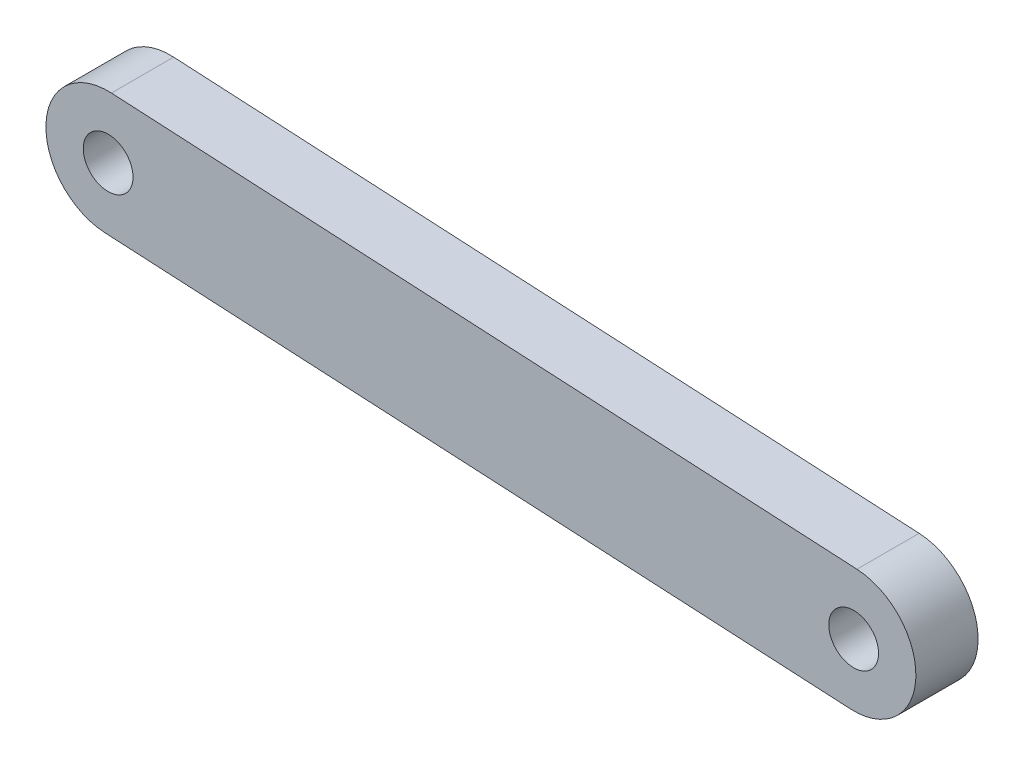
ISO-10303-21;
HEADER;
FILE_DESCRIPTION(('STEP AP214'),'2;1');
FILE_NAME('part.step','',(''),(''),'','','');
FILE_SCHEMA(('AUTOMOTIVE_DESIGN { 1 0 10303 214 1 1 1 1 }'));
ENDSEC;
DATA;
#1=APPLICATION_CONTEXT('core data for automotive mechanical design processes');
#2=APPLICATION_PROTOCOL_DEFINITION('international standard','automotive_design',2000,#1);
#3=PRODUCT_CONTEXT('',#1,'mechanical');
#4=PRODUCT('Part','Part','',(#3));
#5=PRODUCT_RELATED_PRODUCT_CATEGORY('part','',(#4));
#6=PRODUCT_DEFINITION_FORMATION('','',#4);
#7=PRODUCT_DEFINITION_CONTEXT('part definition',#1,'design');
#8=PRODUCT_DEFINITION('design','',#6,#7);
#9=PRODUCT_DEFINITION_SHAPE('','',#8);
#10=(LENGTH_UNIT() NAMED_UNIT(*) SI_UNIT(.MILLI.,.METRE.));
#11=(NAMED_UNIT(*) PLANE_ANGLE_UNIT() SI_UNIT($,.RADIAN.));
#12=(NAMED_UNIT(*) SI_UNIT($,.STERADIAN.) SOLID_ANGLE_UNIT());
#13=UNCERTAINTY_MEASURE_WITH_UNIT(LENGTH_MEASURE(1.E-05),#10,'distance_accuracy_value','');
#14=(GEOMETRIC_REPRESENTATION_CONTEXT(3) GLOBAL_UNCERTAINTY_ASSIGNED_CONTEXT((#13)) GLOBAL_UNIT_ASSIGNED_CONTEXT((#10,
#11,#12)) REPRESENTATION_CONTEXT('',''));
#15=CARTESIAN_POINT('',(0.,0.,0.));
#16=DIRECTION('',(0.,0.,1.));
#17=DIRECTION('',(1.,0.,0.));
#18=AXIS2_PLACEMENT_3D('',#15,#16,#17);
#19=CARTESIAN_POINT('',(-35.5373266073171,-8.81247047670461,5.));
#20=DIRECTION('',(0.,0.,1.));
#21=DIRECTION('',(0.,-1.,0.));
#22=AXIS2_PLACEMENT_3D('',#19,#20,#21);
#23=PLANE('',#22);
#24=CARTESIAN_POINT('',(-35.5373266073171,-8.81247047670461,5.));
#25=DIRECTION('',(0.,0.,1.));
#26=DIRECTION('',(0.,-1.,0.));
#27=AXIS2_PLACEMENT_3D('',#24,#25,#26);
#28=CIRCLE('',#27,2.);
#29=CARTESIAN_POINT('',(-35.5373266073171,-10.8124704767046,5.));
#30=VERTEX_POINT('',#29);
#31=EDGE_CURVE('E102',#30,#30,#28,.T.);
#32=ORIENTED_EDGE('',*,*,#31,.F.);
#33=EDGE_LOOP('',(#32));
#34=FACE_BOUND('',#33,.T.);
#35=CARTESIAN_POINT('',(-35.5373266073171,-8.81247047670461,5.));
#36=DIRECTION('',(0.,0.,1.));
#37=DIRECTION('',(0.,-1.,0.));
#38=AXIS2_PLACEMENT_3D('',#35,#36,#37);
#39=CIRCLE('',#38,5.);
#40=CARTESIAN_POINT('',(-35.802717202182,-13.8054222922299,5.));
#41=VERTEX_POINT('',#40);
#42=CARTESIAN_POINT('',(-35.2719360124522,-3.81951866117932,5.));
#43=VERTEX_POINT('',#42);
#44=EDGE_CURVE('E87',#41,#43,#39,.T.);
#45=ORIENTED_EDGE('',*,*,#44,.T.);
#46=DIRECTION('',(-0.998590363105057,0.0530781189729777,0.));
#47=VECTOR('',#46,1.);
#48=CARTESIAN_POINT('',(-35.2719360124522,-3.81951866117932,5.));
#49=LINE('',#48,#47);
#50=CARTESIAN_POINT('',(-95.1873577987556,-0.634831522800653,5.));
#51=VERTEX_POINT('',#50);
#52=EDGE_CURVE('E82',#43,#51,#49,.T.);
#53=ORIENTED_EDGE('',*,*,#52,.T.);
#54=CARTESIAN_POINT('',(-95.4527483936205,-5.62778333832594,5.));
#55=DIRECTION('',(0.,0.,1.));
#56=DIRECTION('',(0.,1.,0.));
#57=AXIS2_PLACEMENT_3D('',#54,#55,#56);
#58=CIRCLE('',#57,4.99999999999999);
#59=CARTESIAN_POINT('',(-95.7181389884854,-10.6207351538512,5.));
#60=VERTEX_POINT('',#59);
#61=EDGE_CURVE('E85',#51,#60,#58,.T.);
#62=ORIENTED_EDGE('',*,*,#61,.T.);
#63=DIRECTION('',(0.998590363105057,-0.053078118972978,0.));
#64=VECTOR('',#63,1.);
#65=CARTESIAN_POINT('',(-35.802717202182,-13.8054222922299,5.));
#66=LINE('',#65,#64);
#67=EDGE_CURVE('E52',#60,#41,#66,.T.);
#68=ORIENTED_EDGE('',*,*,#67,.T.);
#69=EDGE_LOOP('',(#45,#53,#62,#68));
#70=FACE_BOUND('',#69,.T.);
#71=CARTESIAN_POINT('',(-95.4527483936205,-5.62778333832594,5.));
#72=DIRECTION('',(0.,0.,1.));
#73=DIRECTION('',(0.,-1.,0.));
#74=AXIS2_PLACEMENT_3D('',#71,#72,#73);
#75=CIRCLE('',#74,2.);
#76=CARTESIAN_POINT('',(-95.4527483936205,-7.62778333832594,5.));
#77=VERTEX_POINT('',#76);
#78=EDGE_CURVE('E117',#77,#77,#75,.T.);
#79=ORIENTED_EDGE('',*,*,#78,.F.);
#80=EDGE_LOOP('',(#79));
#81=FACE_BOUND('',#80,.T.);
#82=ADVANCED_FACE('F35',(#34,#70,#81),#23,.T.);
#83=CARTESIAN_POINT('',(-35.5373266073171,-8.81247047670461,0.));
#84=DIRECTION('',(0.,0.,1.));
#85=DIRECTION('',(0.,-1.,0.));
#86=AXIS2_PLACEMENT_3D('',#83,#84,#85);
#87=PLANE('',#86);
#88=CARTESIAN_POINT('',(-35.5373266073171,-8.81247047670461,0.));
#89=DIRECTION('',(0.,0.,1.));
#90=DIRECTION('',(0.,-1.,0.));
#91=AXIS2_PLACEMENT_3D('',#88,#89,#90);
#92=CIRCLE('',#91,5.);
#93=CARTESIAN_POINT('',(-35.802717202182,-13.8054222922299,0.));
#94=VERTEX_POINT('',#93);
#95=CARTESIAN_POINT('',(-35.2719360124522,-3.81951866117932,0.));
#96=VERTEX_POINT('',#95);
#97=EDGE_CURVE('E99',#94,#96,#92,.T.);
#98=ORIENTED_EDGE('',*,*,#97,.F.);
#99=DIRECTION('',(0.998590363105057,-0.053078118972978,0.));
#100=VECTOR('',#99,1.);
#101=CARTESIAN_POINT('',(-35.802717202182,-13.8054222922299,0.));
#102=LINE('',#101,#100);
#103=CARTESIAN_POINT('',(-95.7181389884854,-10.6207351538512,0.));
#104=VERTEX_POINT('',#103);
#105=EDGE_CURVE('E75',#104,#94,#102,.T.);
#106=ORIENTED_EDGE('',*,*,#105,.F.);
#107=CARTESIAN_POINT('',(-95.4527483936205,-5.62778333832593,0.));
#108=DIRECTION('',(0.,0.,1.));
#109=DIRECTION('',(0.,1.,0.));
#110=AXIS2_PLACEMENT_3D('',#107,#108,#109);
#111=CIRCLE('',#110,4.99999999999999);
#112=CARTESIAN_POINT('',(-95.1873577987556,-0.634831522800652,0.));
#113=VERTEX_POINT('',#112);
#114=EDGE_CURVE('E69',#113,#104,#111,.T.);
#115=ORIENTED_EDGE('',*,*,#114,.F.);
#116=DIRECTION('',(-0.998590363105057,0.0530781189729777,0.));
#117=VECTOR('',#116,1.);
#118=CARTESIAN_POINT('',(-35.2719360124522,-3.81951866117932,0.));
#119=LINE('',#118,#117);
#120=EDGE_CURVE('E91',#96,#113,#119,.T.);
#121=ORIENTED_EDGE('',*,*,#120,.F.);
#122=EDGE_LOOP('',(#98,#106,#115,#121));
#123=FACE_BOUND('',#122,.T.);
#124=CARTESIAN_POINT('',(-35.5373266073171,-8.81247047670461,0.));
#125=DIRECTION('',(0.,0.,1.));
#126=DIRECTION('',(0.,-1.,0.));
#127=AXIS2_PLACEMENT_3D('',#124,#125,#126);
#128=CIRCLE('',#127,2.);
#129=CARTESIAN_POINT('',(-35.5373266073171,-10.8124704767046,0.));
#130=VERTEX_POINT('',#129);
#131=EDGE_CURVE('E114',#130,#130,#128,.T.);
#132=ORIENTED_EDGE('',*,*,#131,.T.);
#133=EDGE_LOOP('',(#132));
#134=FACE_BOUND('',#133,.T.);
#135=CARTESIAN_POINT('',(-95.4527483936205,-5.62778333832593,0.));
#136=DIRECTION('',(0.,0.,1.));
#137=DIRECTION('',(0.,-1.,0.));
#138=AXIS2_PLACEMENT_3D('',#135,#136,#137);
#139=CIRCLE('',#138,2.);
#140=CARTESIAN_POINT('',(-95.4527483936205,-7.62778333832594,0.));
#141=VERTEX_POINT('',#140);
#142=EDGE_CURVE('E120',#141,#141,#139,.T.);
#143=ORIENTED_EDGE('',*,*,#142,.T.);
#144=EDGE_LOOP('',(#143));
#145=FACE_BOUND('',#144,.T.);
#146=ADVANCED_FACE('F110',(#123,#134,#145),#87,.F.);
#147=CARTESIAN_POINT('',(-35.5373266073171,-8.81247047670461,5.));
#148=DIRECTION('',(0.,0.,-1.));
#149=DIRECTION('',(0.,1.,0.));
#150=AXIS2_PLACEMENT_3D('',#147,#148,#149);
#151=CYLINDRICAL_SURFACE('',#150,5.);
#152=ORIENTED_EDGE('',*,*,#97,.T.);
#153=DIRECTION('',(0.,0.,-1.));
#154=VECTOR('',#153,1.);
#155=CARTESIAN_POINT('',(-35.2719360124522,-3.81951866117932,5.));
#156=LINE('',#155,#154);
#157=EDGE_CURVE('E11',#43,#96,#156,.T.);
#158=ORIENTED_EDGE('',*,*,#157,.F.);
#159=ORIENTED_EDGE('',*,*,#44,.F.);
#160=DIRECTION('',(0.,0.,-1.));
#161=VECTOR('',#160,1.);
#162=CARTESIAN_POINT('',(-35.802717202182,-13.8054222922299,5.));
#163=LINE('',#162,#161);
#164=EDGE_CURVE('E95',#41,#94,#163,.T.);
#165=ORIENTED_EDGE('',*,*,#164,.T.);
#166=EDGE_LOOP('',(#152,#158,#159,#165));
#167=FACE_BOUND('',#166,.T.);
#168=ADVANCED_FACE('F37',(#167),#151,.T.);
#169=CARTESIAN_POINT('',(-35.2719360124522,-3.81951866117932,5.));
#170=DIRECTION('',(-0.0530781189729777,-0.998590363105058,0.));
#171=DIRECTION('',(0.998590363105058,-0.0530781189729777,0.));
#172=AXIS2_PLACEMENT_3D('',#169,#170,#171);
#173=PLANE('',#172);
#174=ORIENTED_EDGE('',*,*,#120,.T.);
#175=DIRECTION('',(0.,0.,-1.));
#176=VECTOR('',#175,1.);
#177=CARTESIAN_POINT('',(-95.1873577987556,-0.634831522800653,5.));
#178=LINE('',#177,#176);
#179=EDGE_CURVE('E44',#51,#113,#178,.T.);
#180=ORIENTED_EDGE('',*,*,#179,.F.);
#181=ORIENTED_EDGE('',*,*,#52,.F.);
#182=ORIENTED_EDGE('',*,*,#157,.T.);
#183=EDGE_LOOP('',(#174,#180,#181,#182));
#184=FACE_BOUND('',#183,.T.);
#185=ADVANCED_FACE('F90',(#184),#173,.F.);
#186=CARTESIAN_POINT('',(-95.4527483936205,-5.62778333832594,5.));
#187=DIRECTION('',(0.,0.,-1.));
#188=DIRECTION('',(0.,1.,0.));
#189=AXIS2_PLACEMENT_3D('',#186,#187,#188);
#190=CYLINDRICAL_SURFACE('',#189,4.99999999999999);
#191=ORIENTED_EDGE('',*,*,#114,.T.);
#192=DIRECTION('',(0.,0.,-1.));
#193=VECTOR('',#192,1.);
#194=CARTESIAN_POINT('',(-95.7181389884854,-10.6207351538512,5.));
#195=LINE('',#194,#193);
#196=EDGE_CURVE('E92',#60,#104,#195,.T.);
#197=ORIENTED_EDGE('',*,*,#196,.F.);
#198=ORIENTED_EDGE('',*,*,#61,.F.);
#199=ORIENTED_EDGE('',*,*,#179,.T.);
#200=EDGE_LOOP('',(#191,#197,#198,#199));
#201=FACE_BOUND('',#200,.T.);
#202=ADVANCED_FACE('F93',(#201),#190,.T.);
#203=CARTESIAN_POINT('',(-35.802717202182,-13.8054222922299,5.));
#204=DIRECTION('',(0.053078118972978,0.998590363105057,0.));
#205=DIRECTION('',(-0.998590363105058,0.053078118972978,0.));
#206=AXIS2_PLACEMENT_3D('',#203,#204,#205);
#207=PLANE('',#206);
#208=ORIENTED_EDGE('',*,*,#105,.T.);
#209=ORIENTED_EDGE('',*,*,#164,.F.);
#210=ORIENTED_EDGE('',*,*,#67,.F.);
#211=ORIENTED_EDGE('',*,*,#196,.T.);
#212=EDGE_LOOP('',(#208,#209,#210,#211));
#213=FACE_BOUND('',#212,.T.);
#214=ADVANCED_FACE('F107',(#213),#207,.F.);
#215=CARTESIAN_POINT('',(-35.5373266073171,-8.81247047670461,5.));
#216=DIRECTION('',(0.,0.,-1.));
#217=DIRECTION('',(0.,1.,0.));
#218=AXIS2_PLACEMENT_3D('',#215,#216,#217);
#219=CYLINDRICAL_SURFACE('',#218,2.);
#220=ORIENTED_EDGE('',*,*,#31,.T.);
#221=EDGE_LOOP('',(#220));
#222=FACE_BOUND('',#221,.T.);
#223=ORIENTED_EDGE('',*,*,#131,.F.);
#224=EDGE_LOOP('',(#223));
#225=FACE_BOUND('',#224,.T.);
#226=ADVANCED_FACE('F137',(#222,#225),#219,.F.);
#227=CARTESIAN_POINT('',(-95.4527483936205,-5.62778333832594,5.));
#228=DIRECTION('',(0.,0.,-1.));
#229=DIRECTION('',(0.,1.,0.));
#230=AXIS2_PLACEMENT_3D('',#227,#228,#229);
#231=CYLINDRICAL_SURFACE('',#230,2.);
#232=ORIENTED_EDGE('',*,*,#78,.T.);
#233=EDGE_LOOP('',(#232));
#234=FACE_BOUND('',#233,.T.);
#235=ORIENTED_EDGE('',*,*,#142,.F.);
#236=EDGE_LOOP('',(#235));
#237=FACE_BOUND('',#236,.T.);
#238=ADVANCED_FACE('F126',(#234,#237),#231,.F.);
#239=CLOSED_SHELL('',(#82,#146,#168,#185,#202,#214,#226,#238));
#240=MANIFOLD_SOLID_BREP('B2',#239);
#241=ADVANCED_BREP_SHAPE_REPRESENTATION('',(#18,#240),#14);
#242=SHAPE_DEFINITION_REPRESENTATION(#9,#241);
ENDSEC;
END-ISO-10303-21;
